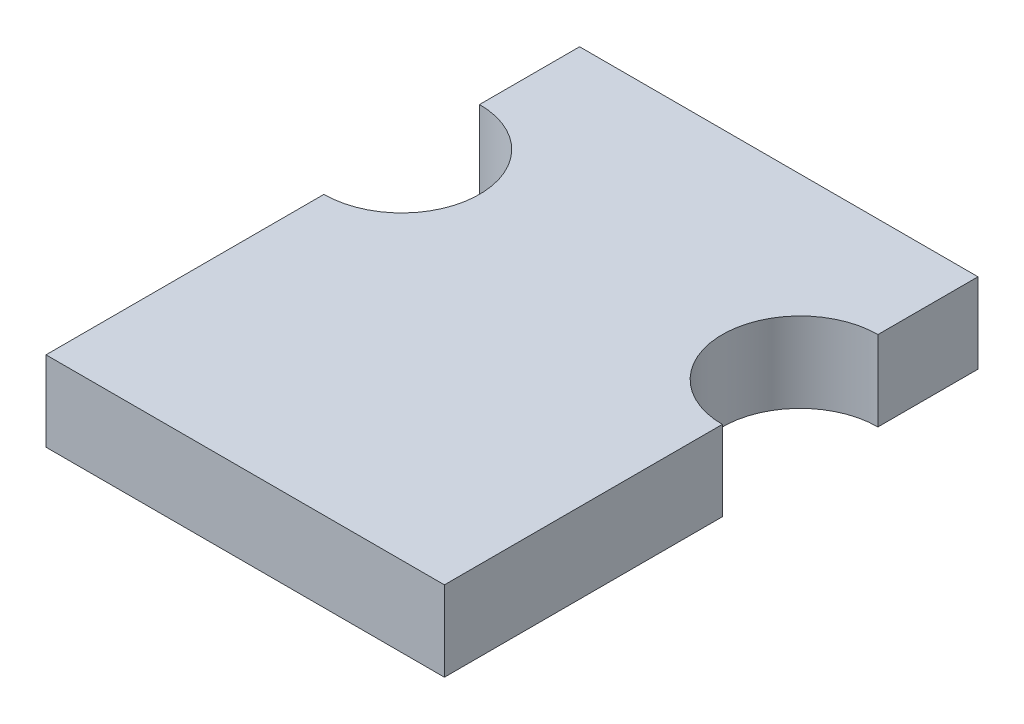
ISO-10303-21;
HEADER;
FILE_DESCRIPTION(('STEP AP214'),'2;1');
FILE_NAME('part.step','',(''),(''),'','','');
FILE_SCHEMA(('AUTOMOTIVE_DESIGN { 1 0 10303 214 1 1 1 1 }'));
ENDSEC;
DATA;
#1=APPLICATION_CONTEXT('core data for automotive mechanical design processes');
#2=APPLICATION_PROTOCOL_DEFINITION('international standard','automotive_design',2000,#1);
#3=PRODUCT_CONTEXT('',#1,'mechanical');
#4=PRODUCT('Part','Part','',(#3));
#5=PRODUCT_RELATED_PRODUCT_CATEGORY('part','',(#4));
#6=PRODUCT_DEFINITION_FORMATION('','',#4);
#7=PRODUCT_DEFINITION_CONTEXT('part definition',#1,'design');
#8=PRODUCT_DEFINITION('design','',#6,#7);
#9=PRODUCT_DEFINITION_SHAPE('','',#8);
#10=(LENGTH_UNIT() NAMED_UNIT(*) SI_UNIT(.MILLI.,.METRE.));
#11=(NAMED_UNIT(*) PLANE_ANGLE_UNIT() SI_UNIT($,.RADIAN.));
#12=(NAMED_UNIT(*) SI_UNIT($,.STERADIAN.) SOLID_ANGLE_UNIT());
#13=UNCERTAINTY_MEASURE_WITH_UNIT(LENGTH_MEASURE(1.E-05),#10,'distance_accuracy_value','');
#14=(GEOMETRIC_REPRESENTATION_CONTEXT(3) GLOBAL_UNCERTAINTY_ASSIGNED_CONTEXT((#13)) GLOBAL_UNIT_ASSIGNED_CONTEXT((#10,
#11,#12)) REPRESENTATION_CONTEXT('',''));
#15=CARTESIAN_POINT('',(0.,0.,0.));
#16=DIRECTION('',(0.,0.,1.));
#17=DIRECTION('',(1.,0.,0.));
#18=AXIS2_PLACEMENT_3D('',#15,#16,#17);
#19=CARTESIAN_POINT('',(0.,1.8,0.));
#20=DIRECTION('',(-1.,0.,0.));
#21=DIRECTION('',(0.,0.,1.));
#22=AXIS2_PLACEMENT_3D('',#19,#20,#21);
#23=PLANE('',#22);
#24=DIRECTION('',(0.,0.,-1.));
#25=VECTOR('',#24,1.);
#26=CARTESIAN_POINT('',(0.,0.,0.));
#27=LINE('',#26,#25);
#28=CARTESIAN_POINT('',(0.,0.,0.));
#29=VERTEX_POINT('',#28);
#30=CARTESIAN_POINT('',(0.,0.,-6.25));
#31=VERTEX_POINT('',#30);
#32=EDGE_CURVE('E129',#29,#31,#27,.T.);
#33=ORIENTED_EDGE('',*,*,#32,.T.);
#34=DIRECTION('',(0.,-1.,0.));
#35=VECTOR('',#34,1.);
#36=CARTESIAN_POINT('',(0.,1.8,-6.25));
#37=LINE('',#36,#35);
#38=CARTESIAN_POINT('',(0.,1.8,-6.25));
#39=VERTEX_POINT('',#38);
#40=EDGE_CURVE('E11',#39,#31,#37,.T.);
#41=ORIENTED_EDGE('',*,*,#40,.F.);
#42=DIRECTION('',(0.,0.,-1.));
#43=VECTOR('',#42,1.);
#44=CARTESIAN_POINT('',(0.,1.8,0.));
#45=LINE('',#44,#43);
#46=CARTESIAN_POINT('',(0.,1.8,0.));
#47=VERTEX_POINT('',#46);
#48=EDGE_CURVE('E143',#47,#39,#45,.T.);
#49=ORIENTED_EDGE('',*,*,#48,.F.);
#50=DIRECTION('',(0.,-1.,0.));
#51=VECTOR('',#50,1.);
#52=CARTESIAN_POINT('',(0.,1.8,0.));
#53=LINE('',#52,#51);
#54=EDGE_CURVE('E125',#47,#29,#53,.T.);
#55=ORIENTED_EDGE('',*,*,#54,.T.);
#56=EDGE_LOOP('',(#33,#41,#49,#55));
#57=FACE_BOUND('',#56,.T.);
#58=ADVANCED_FACE('F33',(#57),#23,.F.);
#59=CARTESIAN_POINT('',(0.,1.8,-8.));
#60=DIRECTION('',(0.,-1.,0.));
#61=DIRECTION('',(0.,0.,-1.));
#62=AXIS2_PLACEMENT_3D('',#59,#60,#61);
#63=CYLINDRICAL_SURFACE('',#62,1.75);
#64=CARTESIAN_POINT('',(0.,0.,-8.));
#65=DIRECTION('',(0.,-1.,0.));
#66=DIRECTION('',(0.,0.,-1.));
#67=AXIS2_PLACEMENT_3D('',#64,#65,#66);
#68=CIRCLE('',#67,1.75);
#69=CARTESIAN_POINT('',(0.,0.,-9.75));
#70=VERTEX_POINT('',#69);
#71=EDGE_CURVE('E132',#31,#70,#68,.T.);
#72=ORIENTED_EDGE('',*,*,#71,.T.);
#73=DIRECTION('',(0.,-1.,0.));
#74=VECTOR('',#73,1.);
#75=CARTESIAN_POINT('',(0.,1.8,-9.75));
#76=LINE('',#75,#74);
#77=CARTESIAN_POINT('',(0.,1.8,-9.75));
#78=VERTEX_POINT('',#77);
#79=EDGE_CURVE('E41',#78,#70,#76,.T.);
#80=ORIENTED_EDGE('',*,*,#79,.F.);
#81=CARTESIAN_POINT('',(0.,1.8,-8.));
#82=DIRECTION('',(0.,-1.,0.));
#83=DIRECTION('',(0.,0.,-1.));
#84=AXIS2_PLACEMENT_3D('',#81,#82,#83);
#85=CIRCLE('',#84,1.75);
#86=EDGE_CURVE('E92',#39,#78,#85,.T.);
#87=ORIENTED_EDGE('',*,*,#86,.F.);
#88=ORIENTED_EDGE('',*,*,#40,.T.);
#89=EDGE_LOOP('',(#72,#80,#87,#88));
#90=FACE_BOUND('',#89,.T.);
#91=ADVANCED_FACE('F178',(#90),#63,.F.);
#92=CARTESIAN_POINT('',(0.,1.8,-9.75));
#93=DIRECTION('',(-1.,0.,0.));
#94=DIRECTION('',(0.,0.,1.));
#95=AXIS2_PLACEMENT_3D('',#92,#93,#94);
#96=PLANE('',#95);
#97=DIRECTION('',(0.,0.,-1.));
#98=VECTOR('',#97,1.);
#99=CARTESIAN_POINT('',(0.,0.,-9.75));
#100=LINE('',#99,#98);
#101=CARTESIAN_POINT('',(0.,0.,-12.));
#102=VERTEX_POINT('',#101);
#103=EDGE_CURVE('E134',#70,#102,#100,.T.);
#104=ORIENTED_EDGE('',*,*,#103,.T.);
#105=DIRECTION('',(0.,-1.,0.));
#106=VECTOR('',#105,1.);
#107=CARTESIAN_POINT('',(0.,1.8,-12.));
#108=LINE('',#107,#106);
#109=CARTESIAN_POINT('',(0.,1.8,-12.));
#110=VERTEX_POINT('',#109);
#111=EDGE_CURVE('E150',#110,#102,#108,.T.);
#112=ORIENTED_EDGE('',*,*,#111,.F.);
#113=DIRECTION('',(0.,0.,-1.));
#114=VECTOR('',#113,1.);
#115=CARTESIAN_POINT('',(0.,1.8,-9.75));
#116=LINE('',#115,#114);
#117=EDGE_CURVE('E158',#78,#110,#116,.T.);
#118=ORIENTED_EDGE('',*,*,#117,.F.);
#119=ORIENTED_EDGE('',*,*,#79,.T.);
#120=EDGE_LOOP('',(#104,#112,#118,#119));
#121=FACE_BOUND('',#120,.T.);
#122=ADVANCED_FACE('F156',(#121),#96,.F.);
#123=CARTESIAN_POINT('',(0.,1.8,-12.));
#124=DIRECTION('',(0.,0.,1.));
#125=DIRECTION('',(1.,0.,0.));
#126=AXIS2_PLACEMENT_3D('',#123,#124,#125);
#127=PLANE('',#126);
#128=DIRECTION('',(-1.,0.,0.));
#129=VECTOR('',#128,1.);
#130=CARTESIAN_POINT('',(0.,0.,-12.));
#131=LINE('',#130,#129);
#132=CARTESIAN_POINT('',(-8.96,0.,-12.));
#133=VERTEX_POINT('',#132);
#134=EDGE_CURVE('E136',#102,#133,#131,.T.);
#135=ORIENTED_EDGE('',*,*,#134,.T.);
#136=DIRECTION('',(0.,-1.,0.));
#137=VECTOR('',#136,1.);
#138=CARTESIAN_POINT('',(-8.96,1.8,-12.));
#139=LINE('',#138,#137);
#140=CARTESIAN_POINT('',(-8.96,1.8,-12.));
#141=VERTEX_POINT('',#140);
#142=EDGE_CURVE('E147',#141,#133,#139,.T.);
#143=ORIENTED_EDGE('',*,*,#142,.F.);
#144=DIRECTION('',(-1.,0.,0.));
#145=VECTOR('',#144,1.);
#146=CARTESIAN_POINT('',(0.,1.8,-12.));
#147=LINE('',#146,#145);
#148=EDGE_CURVE('E170',#110,#141,#147,.T.);
#149=ORIENTED_EDGE('',*,*,#148,.F.);
#150=ORIENTED_EDGE('',*,*,#111,.T.);
#151=EDGE_LOOP('',(#135,#143,#149,#150));
#152=FACE_BOUND('',#151,.T.);
#153=ADVANCED_FACE('F166',(#152),#127,.F.);
#154=CARTESIAN_POINT('',(-8.96,1.8,-9.75));
#155=DIRECTION('',(1.,0.,0.));
#156=DIRECTION('',(0.,0.,-1.));
#157=AXIS2_PLACEMENT_3D('',#154,#155,#156);
#158=PLANE('',#157);
#159=DIRECTION('',(0.,0.,1.));
#160=VECTOR('',#159,1.);
#161=CARTESIAN_POINT('',(-8.96,0.,-9.75));
#162=LINE('',#161,#160);
#163=CARTESIAN_POINT('',(-8.96,0.,-9.75));
#164=VERTEX_POINT('',#163);
#165=EDGE_CURVE('E138',#133,#164,#162,.T.);
#166=ORIENTED_EDGE('',*,*,#165,.T.);
#167=DIRECTION('',(0.,-1.,0.));
#168=VECTOR('',#167,1.);
#169=CARTESIAN_POINT('',(-8.96,1.8,-9.75));
#170=LINE('',#169,#168);
#171=CARTESIAN_POINT('',(-8.96,1.8,-9.75));
#172=VERTEX_POINT('',#171);
#173=EDGE_CURVE('E120',#172,#164,#170,.T.);
#174=ORIENTED_EDGE('',*,*,#173,.F.);
#175=DIRECTION('',(0.,0.,1.));
#176=VECTOR('',#175,1.);
#177=CARTESIAN_POINT('',(-8.96,1.8,-9.75));
#178=LINE('',#177,#176);
#179=EDGE_CURVE('E111',#141,#172,#178,.T.);
#180=ORIENTED_EDGE('',*,*,#179,.F.);
#181=ORIENTED_EDGE('',*,*,#142,.T.);
#182=EDGE_LOOP('',(#166,#174,#180,#181));
#183=FACE_BOUND('',#182,.T.);
#184=ADVANCED_FACE('F169',(#183),#158,.F.);
#185=CARTESIAN_POINT('',(-8.96,1.8,-8.));
#186=DIRECTION('',(0.,-1.,0.));
#187=DIRECTION('',(0.,0.,-1.));
#188=AXIS2_PLACEMENT_3D('',#185,#186,#187);
#189=CYLINDRICAL_SURFACE('',#188,1.75);
#190=CARTESIAN_POINT('',(-8.96,0.,-8.));
#191=DIRECTION('',(0.,-1.,0.));
#192=DIRECTION('',(0.,0.,1.));
#193=AXIS2_PLACEMENT_3D('',#190,#191,#192);
#194=CIRCLE('',#193,1.75);
#195=CARTESIAN_POINT('',(-8.96,0.,-6.25));
#196=VERTEX_POINT('',#195);
#197=EDGE_CURVE('E119',#164,#196,#194,.T.);
#198=ORIENTED_EDGE('',*,*,#197,.T.);
#199=DIRECTION('',(0.,-1.,0.));
#200=VECTOR('',#199,1.);
#201=CARTESIAN_POINT('',(-8.96,1.8,-6.25));
#202=LINE('',#201,#200);
#203=CARTESIAN_POINT('',(-8.96,1.8,-6.25));
#204=VERTEX_POINT('',#203);
#205=EDGE_CURVE('E116',#204,#196,#202,.T.);
#206=ORIENTED_EDGE('',*,*,#205,.F.);
#207=CARTESIAN_POINT('',(-8.96,1.8,-8.));
#208=DIRECTION('',(0.,-1.,0.));
#209=DIRECTION('',(0.,0.,1.));
#210=AXIS2_PLACEMENT_3D('',#207,#208,#209);
#211=CIRCLE('',#210,1.75);
#212=EDGE_CURVE('E105',#172,#204,#211,.T.);
#213=ORIENTED_EDGE('',*,*,#212,.F.);
#214=ORIENTED_EDGE('',*,*,#173,.T.);
#215=EDGE_LOOP('',(#198,#206,#213,#214));
#216=FACE_BOUND('',#215,.T.);
#217=ADVANCED_FACE('F117',(#216),#189,.F.);
#218=CARTESIAN_POINT('',(-8.96,1.8,0.));
#219=DIRECTION('',(1.,0.,0.));
#220=DIRECTION('',(0.,0.,-1.));
#221=AXIS2_PLACEMENT_3D('',#218,#219,#220);
#222=PLANE('',#221);
#223=DIRECTION('',(0.,0.,1.));
#224=VECTOR('',#223,1.);
#225=CARTESIAN_POINT('',(-8.96,0.,0.));
#226=LINE('',#225,#224);
#227=CARTESIAN_POINT('',(-8.96,0.,0.));
#228=VERTEX_POINT('',#227);
#229=EDGE_CURVE('E78',#196,#228,#226,.T.);
#230=ORIENTED_EDGE('',*,*,#229,.T.);
#231=DIRECTION('',(0.,-1.,0.));
#232=VECTOR('',#231,1.);
#233=CARTESIAN_POINT('',(-8.96,1.8,0.));
#234=LINE('',#233,#232);
#235=CARTESIAN_POINT('',(-8.96,1.8,0.));
#236=VERTEX_POINT('',#235);
#237=EDGE_CURVE('E121',#236,#228,#234,.T.);
#238=ORIENTED_EDGE('',*,*,#237,.F.);
#239=DIRECTION('',(0.,0.,1.));
#240=VECTOR('',#239,1.);
#241=CARTESIAN_POINT('',(-8.96,1.8,0.));
#242=LINE('',#241,#240);
#243=EDGE_CURVE('E109',#204,#236,#242,.T.);
#244=ORIENTED_EDGE('',*,*,#243,.F.);
#245=ORIENTED_EDGE('',*,*,#205,.T.);
#246=EDGE_LOOP('',(#230,#238,#244,#245));
#247=FACE_BOUND('',#246,.T.);
#248=ADVANCED_FACE('F123',(#247),#222,.F.);
#249=CARTESIAN_POINT('',(0.,1.8,0.));
#250=DIRECTION('',(0.,0.,-1.));
#251=DIRECTION('',(-1.,0.,0.));
#252=AXIS2_PLACEMENT_3D('',#249,#250,#251);
#253=PLANE('',#252);
#254=DIRECTION('',(1.,0.,0.));
#255=VECTOR('',#254,1.);
#256=CARTESIAN_POINT('',(0.,0.,0.));
#257=LINE('',#256,#255);
#258=EDGE_CURVE('E84',#228,#29,#257,.T.);
#259=ORIENTED_EDGE('',*,*,#258,.T.);
#260=ORIENTED_EDGE('',*,*,#54,.F.);
#261=DIRECTION('',(1.,0.,0.));
#262=VECTOR('',#261,1.);
#263=CARTESIAN_POINT('',(0.,1.8,0.));
#264=LINE('',#263,#262);
#265=EDGE_CURVE('E49',#236,#47,#264,.T.);
#266=ORIENTED_EDGE('',*,*,#265,.F.);
#267=ORIENTED_EDGE('',*,*,#237,.T.);
#268=EDGE_LOOP('',(#259,#260,#266,#267));
#269=FACE_BOUND('',#268,.T.);
#270=ADVANCED_FACE('F194',(#269),#253,.F.);
#271=CARTESIAN_POINT('',(0.,1.8,-8.));
#272=DIRECTION('',(0.,-1.,0.));
#273=DIRECTION('',(0.,0.,-1.));
#274=AXIS2_PLACEMENT_3D('',#271,#272,#273);
#275=PLANE('',#274);
#276=ORIENTED_EDGE('',*,*,#48,.T.);
#277=ORIENTED_EDGE('',*,*,#86,.T.);
#278=ORIENTED_EDGE('',*,*,#117,.T.);
#279=ORIENTED_EDGE('',*,*,#148,.T.);
#280=ORIENTED_EDGE('',*,*,#179,.T.);
#281=ORIENTED_EDGE('',*,*,#212,.T.);
#282=ORIENTED_EDGE('',*,*,#243,.T.);
#283=ORIENTED_EDGE('',*,*,#265,.T.);
#284=EDGE_LOOP('',(#276,#277,#278,#279,#280,#281,#282,#283));
#285=FACE_BOUND('',#284,.T.);
#286=ADVANCED_FACE('F107',(#285),#275,.F.);
#287=CARTESIAN_POINT('',(0.,0.,-8.));
#288=DIRECTION('',(0.,-1.,0.));
#289=DIRECTION('',(0.,0.,-1.));
#290=AXIS2_PLACEMENT_3D('',#287,#288,#289);
#291=PLANE('',#290);
#292=ORIENTED_EDGE('',*,*,#32,.F.);
#293=ORIENTED_EDGE('',*,*,#258,.F.);
#294=ORIENTED_EDGE('',*,*,#229,.F.);
#295=ORIENTED_EDGE('',*,*,#197,.F.);
#296=ORIENTED_EDGE('',*,*,#165,.F.);
#297=ORIENTED_EDGE('',*,*,#134,.F.);
#298=ORIENTED_EDGE('',*,*,#103,.F.);
#299=ORIENTED_EDGE('',*,*,#71,.F.);
#300=EDGE_LOOP('',(#292,#293,#294,#295,#296,#297,#298,#299));
#301=FACE_BOUND('',#300,.T.);
#302=ADVANCED_FACE('F162',(#301),#291,.T.);
#303=CLOSED_SHELL('',(#58,#91,#122,#153,#184,#217,#248,#270,#286,#302));
#304=MANIFOLD_SOLID_BREP('B2',#303);
#305=ADVANCED_BREP_SHAPE_REPRESENTATION('',(#18,#304),#14);
#306=SHAPE_DEFINITION_REPRESENTATION(#9,#305);
ENDSEC;
END-ISO-10303-21;
